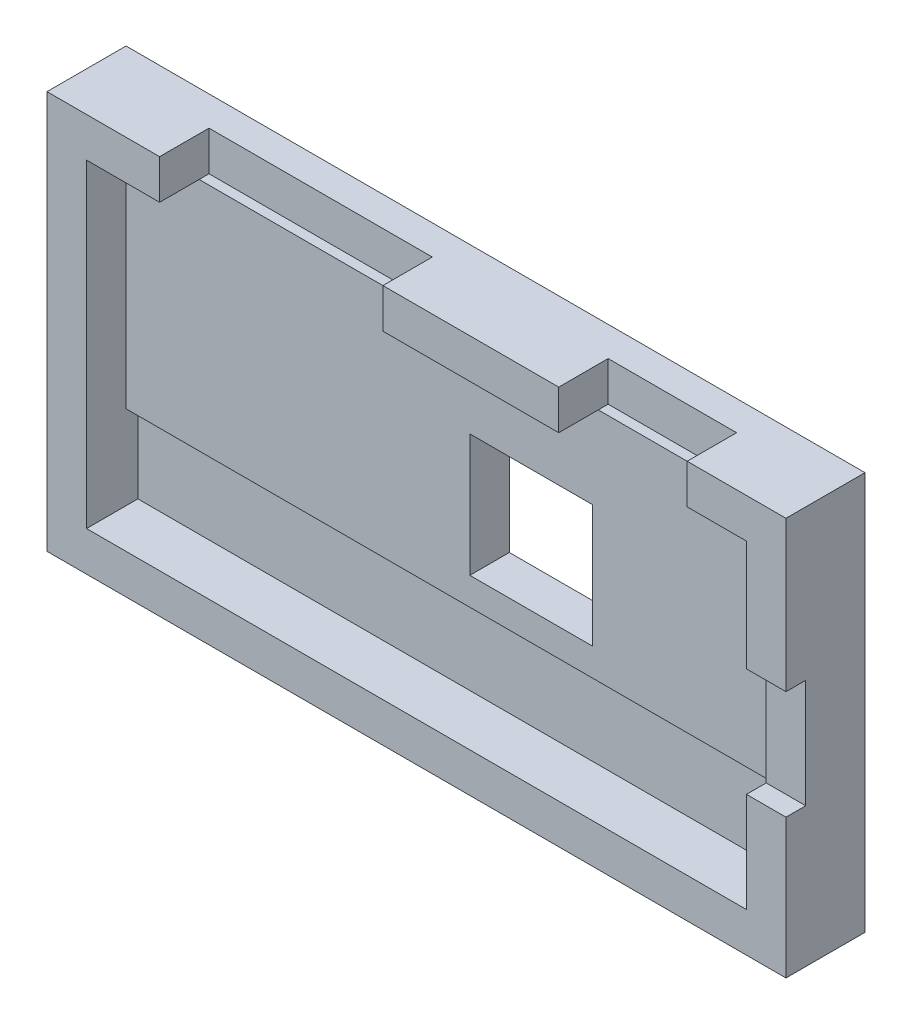
ISO-10303-21;
HEADER;
FILE_DESCRIPTION(('STEP AP214'),'2;1');
FILE_NAME('part.step','',(''),(''),'','','');
FILE_SCHEMA(('AUTOMOTIVE_DESIGN { 1 0 10303 214 1 1 1 1 }'));
ENDSEC;
DATA;
#1=APPLICATION_CONTEXT('core data for automotive mechanical design processes');
#2=APPLICATION_PROTOCOL_DEFINITION('international standard','automotive_design',2000,#1);
#3=PRODUCT_CONTEXT('',#1,'mechanical');
#4=PRODUCT('Part','Part','',(#3));
#5=PRODUCT_RELATED_PRODUCT_CATEGORY('part','',(#4));
#6=PRODUCT_DEFINITION_FORMATION('','',#4);
#7=PRODUCT_DEFINITION_CONTEXT('part definition',#1,'design');
#8=PRODUCT_DEFINITION('design','',#6,#7);
#9=PRODUCT_DEFINITION_SHAPE('','',#8);
#10=(LENGTH_UNIT() NAMED_UNIT(*) SI_UNIT(.MILLI.,.METRE.));
#11=(NAMED_UNIT(*) PLANE_ANGLE_UNIT() SI_UNIT($,.RADIAN.));
#12=(NAMED_UNIT(*) SI_UNIT($,.STERADIAN.) SOLID_ANGLE_UNIT());
#13=UNCERTAINTY_MEASURE_WITH_UNIT(LENGTH_MEASURE(1.E-05),#10,'distance_accuracy_value','');
#14=(GEOMETRIC_REPRESENTATION_CONTEXT(3) GLOBAL_UNCERTAINTY_ASSIGNED_CONTEXT((#13)) GLOBAL_UNIT_ASSIGNED_CONTEXT((#10,
#11,#12)) REPRESENTATION_CONTEXT('',''));
#15=CARTESIAN_POINT('',(0.,0.,0.));
#16=DIRECTION('',(0.,0.,1.));
#17=DIRECTION('',(1.,0.,0.));
#18=AXIS2_PLACEMENT_3D('',#15,#16,#17);
#19=CARTESIAN_POINT('',(0.,0.,8.));
#20=DIRECTION('',(0.,0.,-1.));
#21=DIRECTION('',(-1.,0.,0.));
#22=AXIS2_PLACEMENT_3D('',#19,#20,#21);
#23=PLANE('',#22);
#24=DIRECTION('',(1.,0.,0.));
#25=VECTOR('',#24,1.);
#26=CARTESIAN_POINT('',(0.,20.0792414405778,8.));
#27=LINE('',#26,#25);
#28=CARTESIAN_POINT('',(26.4591512095298,20.0792414405778,8.));
#29=VERTEX_POINT('',#28);
#30=CARTESIAN_POINT('',(36.4591512095298,20.0792414405778,8.));
#31=VERTEX_POINT('',#30);
#32=EDGE_CURVE('E483',#29,#31,#27,.T.);
#33=ORIENTED_EDGE('',*,*,#32,.F.);
#34=DIRECTION('',(0.,1.,0.));
#35=VECTOR('',#34,1.);
#36=CARTESIAN_POINT('',(26.4591512095298,16.0792414405778,8.));
#37=LINE('',#36,#35);
#38=CARTESIAN_POINT('',(26.4591512095298,16.0792414405778,8.));
#39=VERTEX_POINT('',#38);
#40=EDGE_CURVE('E314',#39,#29,#37,.T.);
#41=ORIENTED_EDGE('',*,*,#40,.F.);
#42=DIRECTION('',(1.,0.,0.));
#43=VECTOR('',#42,1.);
#44=CARTESIAN_POINT('',(-34.3408487904702,16.0792414405778,8.));
#45=LINE('',#44,#43);
#46=CARTESIAN_POINT('',(32.4591512095298,16.0792414405778,8.));
#47=VERTEX_POINT('',#46);
#48=EDGE_CURVE('E454',#39,#47,#45,.T.);
#49=ORIENTED_EDGE('',*,*,#48,.T.);
#50=DIRECTION('',(0.,-1.,0.));
#51=VECTOR('',#50,1.);
#52=CARTESIAN_POINT('',(32.4591512095298,16.0792414405778,8.));
#53=LINE('',#52,#51);
#54=CARTESIAN_POINT('',(32.4591512095298,4.87924144057779,8.));
#55=VERTEX_POINT('',#54);
#56=EDGE_CURVE('E455',#47,#55,#53,.T.);
#57=ORIENTED_EDGE('',*,*,#56,.T.);
#58=DIRECTION('',(-1.,0.,0.));
#59=VECTOR('',#58,1.);
#60=CARTESIAN_POINT('',(32.4591512095298,4.87924144057779,8.));
#61=LINE('',#60,#59);
#62=CARTESIAN_POINT('',(36.4591512095298,4.87924144057779,8.));
#63=VERTEX_POINT('',#62);
#64=EDGE_CURVE('E403',#63,#55,#61,.T.);
#65=ORIENTED_EDGE('',*,*,#64,.F.);
#66=DIRECTION('',(0.,-1.,0.));
#67=VECTOR('',#66,1.);
#68=CARTESIAN_POINT('',(36.4591512095298,0.,8.));
#69=LINE('',#68,#67);
#70=EDGE_CURVE('E499',#31,#63,#69,.T.);
#71=ORIENTED_EDGE('',*,*,#70,.F.);
#72=EDGE_LOOP('',(#33,#41,#49,#57,#65,#71));
#73=FACE_BOUND('',#72,.T.);
#74=ADVANCED_FACE('F62',(#73),#23,.F.);
#75=CARTESIAN_POINT('',(-4.34084879047024,16.0792414405778,8.));
#76=VERTEX_POINT('',#75);
#77=CARTESIAN_POINT('',(13.4591512095298,16.0792414405778,8.));
#78=VERTEX_POINT('',#77);
#79=EDGE_CURVE('E453',#76,#78,#45,.T.);
#80=ORIENTED_EDGE('',*,*,#79,.T.);
#81=DIRECTION('',(0.,-1.,0.));
#82=VECTOR('',#81,1.);
#83=CARTESIAN_POINT('',(13.4591512095298,16.0792414405778,8.));
#84=LINE('',#83,#82);
#85=CARTESIAN_POINT('',(13.4591512095298,20.0792414405778,8.));
#86=VERTEX_POINT('',#85);
#87=EDGE_CURVE('E301',#86,#78,#84,.T.);
#88=ORIENTED_EDGE('',*,*,#87,.F.);
#89=CARTESIAN_POINT('',(-4.34084879047024,20.0792414405778,8.));
#90=VERTEX_POINT('',#89);
#91=EDGE_CURVE('E498',#90,#86,#27,.T.);
#92=ORIENTED_EDGE('',*,*,#91,.F.);
#93=DIRECTION('',(0.,1.,0.));
#94=VECTOR('',#93,1.);
#95=CARTESIAN_POINT('',(-4.34084879047024,16.0792414405778,8.));
#96=LINE('',#95,#94);
#97=EDGE_CURVE('E264',#76,#90,#96,.T.);
#98=ORIENTED_EDGE('',*,*,#97,.F.);
#99=EDGE_LOOP('',(#80,#88,#92,#98));
#100=FACE_BOUND('',#99,.T.);
#101=ADVANCED_FACE('F602',(#100),#23,.F.);
#102=CARTESIAN_POINT('',(-34.3408487904702,16.0792414405778,8.));
#103=DIRECTION('',(0.,1.,0.));
#104=DIRECTION('',(0.,0.,1.));
#105=AXIS2_PLACEMENT_3D('',#102,#103,#104);
#106=PLANE('',#105);
#107=ORIENTED_EDGE('',*,*,#48,.F.);
#108=DIRECTION('',(0.,0.,1.));
#109=VECTOR('',#108,1.);
#110=CARTESIAN_POINT('',(26.4591512095298,16.0792414405778,3.));
#111=LINE('',#110,#109);
#112=CARTESIAN_POINT('',(26.4591512095298,16.0792414405778,4.));
#113=VERTEX_POINT('',#112);
#114=EDGE_CURVE('E325',#113,#39,#111,.T.);
#115=ORIENTED_EDGE('',*,*,#114,.F.);
#116=DIRECTION('',(1.,0.,0.));
#117=VECTOR('',#116,1.);
#118=CARTESIAN_POINT('',(-34.3408487904702,16.0792414405778,4.));
#119=LINE('',#118,#117);
#120=CARTESIAN_POINT('',(32.4591512095298,16.0792414405778,4.));
#121=VERTEX_POINT('',#120);
#122=EDGE_CURVE('E447',#113,#121,#119,.T.);
#123=ORIENTED_EDGE('',*,*,#122,.T.);
#124=DIRECTION('',(0.,0.,-1.));
#125=VECTOR('',#124,1.);
#126=CARTESIAN_POINT('',(32.4591512095298,16.0792414405778,8.));
#127=LINE('',#126,#125);
#128=EDGE_CURVE('E466',#47,#121,#127,.T.);
#129=ORIENTED_EDGE('',*,*,#128,.F.);
#130=EDGE_LOOP('',(#107,#115,#123,#129));
#131=FACE_BOUND('',#130,.T.);
#132=ADVANCED_FACE('F666',(#131),#106,.F.);
#133=CARTESIAN_POINT('',(-4.34084879047024,16.0792414405778,4.));
#134=VERTEX_POINT('',#133);
#135=CARTESIAN_POINT('',(13.4591512095298,16.0792414405778,4.));
#136=VERTEX_POINT('',#135);
#137=EDGE_CURVE('E611',#134,#136,#119,.T.);
#138=ORIENTED_EDGE('',*,*,#137,.T.);
#139=DIRECTION('',(0.,0.,1.));
#140=VECTOR('',#139,1.);
#141=CARTESIAN_POINT('',(13.4591512095298,16.0792414405778,3.));
#142=LINE('',#141,#140);
#143=EDGE_CURVE('E329',#136,#78,#142,.T.);
#144=ORIENTED_EDGE('',*,*,#143,.T.);
#145=ORIENTED_EDGE('',*,*,#79,.F.);
#146=DIRECTION('',(0.,0.,1.));
#147=VECTOR('',#146,1.);
#148=CARTESIAN_POINT('',(-4.34084879047024,16.0792414405778,3.));
#149=LINE('',#148,#147);
#150=EDGE_CURVE('E361',#134,#76,#149,.T.);
#151=ORIENTED_EDGE('',*,*,#150,.F.);
#152=EDGE_LOOP('',(#138,#144,#145,#151));
#153=FACE_BOUND('',#152,.T.);
#154=ADVANCED_FACE('F673',(#153),#106,.F.);
#155=CARTESIAN_POINT('',(-38.3408487904702,20.0792414405778,4.));
#156=DIRECTION('',(1.,0.,0.));
#157=DIRECTION('',(0.,1.,0.));
#158=AXIS2_PLACEMENT_3D('',#155,#156,#157);
#159=PLANE('',#158);
#160=DIRECTION('',(0.,-1.,0.));
#161=VECTOR('',#160,1.);
#162=CARTESIAN_POINT('',(-38.3408487904702,20.0792414405778,0.));
#163=LINE('',#162,#161);
#164=CARTESIAN_POINT('',(-38.3408487904702,20.0792414405778,0.));
#165=VERTEX_POINT('',#164);
#166=CARTESIAN_POINT('',(-38.3408487904702,-20.2207585594222,0.));
#167=VERTEX_POINT('',#166);
#168=EDGE_CURVE('E511',#165,#167,#163,.T.);
#169=ORIENTED_EDGE('',*,*,#168,.T.);
#170=DIRECTION('',(0.,0.,-1.));
#171=VECTOR('',#170,1.);
#172=CARTESIAN_POINT('',(-38.3408487904702,-20.2207585594222,4.));
#173=LINE('',#172,#171);
#174=CARTESIAN_POINT('',(-38.3408487904702,-20.2207585594222,8.));
#175=VERTEX_POINT('',#174);
#176=EDGE_CURVE('E536',#175,#167,#173,.T.);
#177=ORIENTED_EDGE('',*,*,#176,.F.);
#178=DIRECTION('',(0.,-1.,0.));
#179=VECTOR('',#178,1.);
#180=CARTESIAN_POINT('',(-38.3408487904702,0.,8.));
#181=LINE('',#180,#179);
#182=CARTESIAN_POINT('',(-38.3408487904702,20.0792414405778,8.));
#183=VERTEX_POINT('',#182);
#184=EDGE_CURVE('E507',#183,#175,#181,.T.);
#185=ORIENTED_EDGE('',*,*,#184,.F.);
#186=DIRECTION('',(0.,0.,-1.));
#187=VECTOR('',#186,1.);
#188=CARTESIAN_POINT('',(-38.3408487904702,20.0792414405778,4.));
#189=LINE('',#188,#187);
#190=EDGE_CURVE('E527',#183,#165,#189,.T.);
#191=ORIENTED_EDGE('',*,*,#190,.T.);
#192=EDGE_LOOP('',(#169,#177,#185,#191));
#193=FACE_BOUND('',#192,.T.);
#194=ADVANCED_FACE('F64',(#193),#159,.F.);
#195=CARTESIAN_POINT('',(-38.3408487904702,-20.2207585594222,4.));
#196=DIRECTION('',(0.,1.,0.));
#197=DIRECTION('',(0.,0.,1.));
#198=AXIS2_PLACEMENT_3D('',#195,#196,#197);
#199=PLANE('',#198);
#200=DIRECTION('',(1.,0.,0.));
#201=VECTOR('',#200,1.);
#202=CARTESIAN_POINT('',(-38.3408487904702,-20.2207585594222,0.));
#203=LINE('',#202,#201);
#204=CARTESIAN_POINT('',(36.4591512095298,-20.2207585594222,0.));
#205=VERTEX_POINT('',#204);
#206=EDGE_CURVE('E515',#167,#205,#203,.T.);
#207=ORIENTED_EDGE('',*,*,#206,.T.);
#208=DIRECTION('',(0.,0.,-1.));
#209=VECTOR('',#208,1.);
#210=CARTESIAN_POINT('',(36.4591512095298,-20.2207585594222,4.));
#211=LINE('',#210,#209);
#212=CARTESIAN_POINT('',(36.4591512095298,-20.2207585594222,8.));
#213=VERTEX_POINT('',#212);
#214=EDGE_CURVE('E533',#213,#205,#211,.T.);
#215=ORIENTED_EDGE('',*,*,#214,.F.);
#216=DIRECTION('',(1.,0.,0.));
#217=VECTOR('',#216,1.);
#218=CARTESIAN_POINT('',(0.,-20.2207585594222,8.));
#219=LINE('',#218,#217);
#220=EDGE_CURVE('E503',#175,#213,#219,.T.);
#221=ORIENTED_EDGE('',*,*,#220,.F.);
#222=ORIENTED_EDGE('',*,*,#176,.T.);
#223=EDGE_LOOP('',(#207,#215,#221,#222));
#224=FACE_BOUND('',#223,.T.);
#225=ADVANCED_FACE('F578',(#224),#199,.F.);
#226=CARTESIAN_POINT('',(36.4591512095298,20.0792414405778,4.));
#227=DIRECTION('',(1.,0.,0.));
#228=DIRECTION('',(0.,1.,0.));
#229=AXIS2_PLACEMENT_3D('',#226,#227,#228);
#230=PLANE('',#229);
#231=DIRECTION('',(0.,0.,1.));
#232=VECTOR('',#231,1.);
#233=CARTESIAN_POINT('',(36.4591512095298,4.87924144057779,6.));
#234=LINE('',#233,#232);
#235=CARTESIAN_POINT('',(36.4591512095298,4.87924144057779,6.));
#236=VERTEX_POINT('',#235);
#237=EDGE_CURVE('E423',#236,#63,#234,.T.);
#238=ORIENTED_EDGE('',*,*,#237,.F.);
#239=DIRECTION('',(0.,1.,0.));
#240=VECTOR('',#239,1.);
#241=CARTESIAN_POINT('',(36.4591512095298,4.87924144057779,6.));
#242=LINE('',#241,#240);
#243=CARTESIAN_POINT('',(36.4591512095298,-6.1207585594222,6.));
#244=VERTEX_POINT('',#243);
#245=EDGE_CURVE('E407',#244,#236,#242,.T.);
#246=ORIENTED_EDGE('',*,*,#245,.F.);
#247=DIRECTION('',(0.,0.,1.));
#248=VECTOR('',#247,1.);
#249=CARTESIAN_POINT('',(36.4591512095298,-6.1207585594222,6.));
#250=LINE('',#249,#248);
#251=CARTESIAN_POINT('',(36.4591512095298,-6.1207585594222,8.));
#252=VERTEX_POINT('',#251);
#253=EDGE_CURVE('E426',#244,#252,#250,.T.);
#254=ORIENTED_EDGE('',*,*,#253,.T.);
#255=EDGE_CURVE('E497',#252,#213,#69,.T.);
#256=ORIENTED_EDGE('',*,*,#255,.T.);
#257=ORIENTED_EDGE('',*,*,#214,.T.);
#258=DIRECTION('',(0.,-1.,0.));
#259=VECTOR('',#258,1.);
#260=CARTESIAN_POINT('',(36.4591512095298,20.0792414405778,0.));
#261=LINE('',#260,#259);
#262=CARTESIAN_POINT('',(36.4591512095298,20.0792414405778,0.));
#263=VERTEX_POINT('',#262);
#264=EDGE_CURVE('E519',#263,#205,#261,.T.);
#265=ORIENTED_EDGE('',*,*,#264,.F.);
#266=DIRECTION('',(0.,0.,-1.));
#267=VECTOR('',#266,1.);
#268=CARTESIAN_POINT('',(36.4591512095298,20.0792414405778,4.));
#269=LINE('',#268,#267);
#270=EDGE_CURVE('E530',#31,#263,#269,.T.);
#271=ORIENTED_EDGE('',*,*,#270,.F.);
#272=ORIENTED_EDGE('',*,*,#70,.T.);
#273=EDGE_LOOP('',(#238,#246,#254,#256,#257,#265,#271,#272));
#274=FACE_BOUND('',#273,.T.);
#275=ADVANCED_FACE('F573',(#274),#230,.T.);
#276=CARTESIAN_POINT('',(-38.3408487904702,20.0792414405778,4.));
#277=DIRECTION('',(0.,1.,0.));
#278=DIRECTION('',(-1.,0.,0.));
#279=AXIS2_PLACEMENT_3D('',#276,#277,#278);
#280=PLANE('',#279);
#281=DIRECTION('',(0.,0.,1.));
#282=VECTOR('',#281,1.);
#283=CARTESIAN_POINT('',(26.4591512095298,20.0792414405778,3.));
#284=LINE('',#283,#282);
#285=CARTESIAN_POINT('',(26.4591512095298,20.0792414405778,3.));
#286=VERTEX_POINT('',#285);
#287=EDGE_CURVE('E313',#286,#29,#284,.T.);
#288=ORIENTED_EDGE('',*,*,#287,.T.);
#289=ORIENTED_EDGE('',*,*,#32,.T.);
#290=ORIENTED_EDGE('',*,*,#270,.T.);
#291=DIRECTION('',(1.,0.,0.));
#292=VECTOR('',#291,1.);
#293=CARTESIAN_POINT('',(-38.3408487904702,20.0792414405778,0.));
#294=LINE('',#293,#292);
#295=EDGE_CURVE('E523',#165,#263,#294,.T.);
#296=ORIENTED_EDGE('',*,*,#295,.F.);
#297=ORIENTED_EDGE('',*,*,#190,.F.);
#298=CARTESIAN_POINT('',(-26.9408487904702,20.0792414405778,8.));
#299=VERTEX_POINT('',#298);
#300=EDGE_CURVE('E493',#183,#299,#27,.T.);
#301=ORIENTED_EDGE('',*,*,#300,.T.);
#302=DIRECTION('',(0.,0.,1.));
#303=VECTOR('',#302,1.);
#304=CARTESIAN_POINT('',(-26.9408487904702,20.0792414405778,3.));
#305=LINE('',#304,#303);
#306=CARTESIAN_POINT('',(-26.9408487904702,20.0792414405778,3.));
#307=VERTEX_POINT('',#306);
#308=EDGE_CURVE('E366',#307,#299,#305,.T.);
#309=ORIENTED_EDGE('',*,*,#308,.F.);
#310=DIRECTION('',(-1.,0.,0.));
#311=VECTOR('',#310,1.);
#312=CARTESIAN_POINT('',(-4.34084879047024,20.0792414405778,3.));
#313=LINE('',#312,#311);
#314=CARTESIAN_POINT('',(-4.34084879047024,20.0792414405778,3.));
#315=VERTEX_POINT('',#314);
#316=EDGE_CURVE('E340',#315,#307,#313,.T.);
#317=ORIENTED_EDGE('',*,*,#316,.F.);
#318=DIRECTION('',(0.,0.,1.));
#319=VECTOR('',#318,1.);
#320=CARTESIAN_POINT('',(-4.34084879047024,20.0792414405778,3.));
#321=LINE('',#320,#319);
#322=EDGE_CURVE('E353',#315,#90,#321,.T.);
#323=ORIENTED_EDGE('',*,*,#322,.T.);
#324=ORIENTED_EDGE('',*,*,#91,.T.);
#325=DIRECTION('',(0.,0.,1.));
#326=VECTOR('',#325,1.);
#327=CARTESIAN_POINT('',(13.4591512095298,20.0792414405778,3.));
#328=LINE('',#327,#326);
#329=CARTESIAN_POINT('',(13.4591512095298,20.0792414405778,3.));
#330=VERTEX_POINT('',#329);
#331=EDGE_CURVE('E330',#330,#86,#328,.T.);
#332=ORIENTED_EDGE('',*,*,#331,.F.);
#333=DIRECTION('',(-1.,0.,0.));
#334=VECTOR('',#333,1.);
#335=CARTESIAN_POINT('',(26.4591512095298,20.0792414405778,3.));
#336=LINE('',#335,#334);
#337=EDGE_CURVE('E300',#286,#330,#336,.T.);
#338=ORIENTED_EDGE('',*,*,#337,.F.);
#339=EDGE_LOOP('',(#288,#289,#290,#296,#297,#301,#309,#317,#323,#324,#332,#338));
#340=FACE_BOUND('',#339,.T.);
#341=ADVANCED_FACE('F556',(#340),#280,.T.);
#342=CARTESIAN_POINT('',(0.,0.,0.));
#343=DIRECTION('',(0.,0.,1.));
#344=DIRECTION('',(1.,0.,0.));
#345=AXIS2_PLACEMENT_3D('',#342,#343,#344);
#346=PLANE('',#345);
#347=DIRECTION('',(-1.,0.,0.));
#348=VECTOR('',#347,1.);
#349=CARTESIAN_POINT('',(12.8591512095298,-4.92075855942221,0.));
#350=LINE('',#349,#348);
#351=CARTESIAN_POINT('',(12.8591512095298,-4.92075855942221,0.));
#352=VERTEX_POINT('',#351);
#353=CARTESIAN_POINT('',(0.459151209529758,-4.92075855942221,0.));
#354=VERTEX_POINT('',#353);
#355=EDGE_CURVE('E270',#352,#354,#350,.T.);
#356=ORIENTED_EDGE('',*,*,#355,.F.);
#357=DIRECTION('',(0.,-1.,0.));
#358=VECTOR('',#357,1.);
#359=CARTESIAN_POINT('',(12.8591512095298,-4.92075855942221,0.));
#360=LINE('',#359,#358);
#361=CARTESIAN_POINT('',(12.8591512095298,7.47924144057779,0.));
#362=VERTEX_POINT('',#361);
#363=EDGE_CURVE('E250',#362,#352,#360,.T.);
#364=ORIENTED_EDGE('',*,*,#363,.F.);
#365=DIRECTION('',(1.,0.,0.));
#366=VECTOR('',#365,1.);
#367=CARTESIAN_POINT('',(12.8591512095298,7.47924144057779,0.));
#368=LINE('',#367,#366);
#369=CARTESIAN_POINT('',(0.459151209529758,7.47924144057779,0.));
#370=VERTEX_POINT('',#369);
#371=EDGE_CURVE('E260',#370,#362,#368,.T.);
#372=ORIENTED_EDGE('',*,*,#371,.F.);
#373=DIRECTION('',(0.,1.,0.));
#374=VECTOR('',#373,1.);
#375=CARTESIAN_POINT('',(0.459151209529758,-4.92075855942221,0.));
#376=LINE('',#375,#374);
#377=EDGE_CURVE('E78',#354,#370,#376,.T.);
#378=ORIENTED_EDGE('',*,*,#377,.F.);
#379=EDGE_LOOP('',(#356,#364,#372,#378));
#380=FACE_BOUND('',#379,.T.);
#381=CARTESIAN_POINT('',(-30.3408487904702,-12.2207585594222,0.));
#382=DIRECTION('',(0.,0.,1.));
#383=DIRECTION('',(1.,0.,0.));
#384=AXIS2_PLACEMENT_3D('',#381,#382,#383);
#385=CIRCLE('',#384,2.37361911288066);
#386=CARTESIAN_POINT('',(-27.9672296775896,-12.2207585594222,0.));
#387=VERTEX_POINT('',#386);
#388=EDGE_CURVE('E12',#387,#387,#385,.F.);
#389=ORIENTED_EDGE('',*,*,#388,.F.);
#390=EDGE_LOOP('',(#389));
#391=FACE_BOUND('',#390,.T.);
#392=CARTESIAN_POINT('',(28.4591512095297,-12.2207585594222,0.));
#393=DIRECTION('',(0.,0.,1.));
#394=DIRECTION('',(1.,0.,0.));
#395=AXIS2_PLACEMENT_3D('',#392,#393,#394);
#396=CIRCLE('',#395,2.07603790965965);
#397=CARTESIAN_POINT('',(30.5351891191894,-12.2207585594222,0.));
#398=VERTEX_POINT('',#397);
#399=EDGE_CURVE('E71',#398,#398,#396,.F.);
#400=ORIENTED_EDGE('',*,*,#399,.F.);
#401=EDGE_LOOP('',(#400));
#402=FACE_BOUND('',#401,.T.);
#403=CARTESIAN_POINT('',(-30.3408487904702,12.0792414405778,0.));
#404=DIRECTION('',(0.,0.,1.));
#405=DIRECTION('',(1.,0.,0.));
#406=AXIS2_PLACEMENT_3D('',#403,#404,#405);
#407=CIRCLE('',#406,2.4167692703284);
#408=CARTESIAN_POINT('',(-27.9240795201418,12.0792414405778,0.));
#409=VERTEX_POINT('',#408);
#410=EDGE_CURVE('E544',#409,#409,#407,.F.);
#411=ORIENTED_EDGE('',*,*,#410,.F.);
#412=EDGE_LOOP('',(#411));
#413=FACE_BOUND('',#412,.T.);
#414=CARTESIAN_POINT('',(28.4591512095298,12.0792414405778,0.));
#415=DIRECTION('',(0.,0.,1.));
#416=DIRECTION('',(1.,0.,0.));
#417=AXIS2_PLACEMENT_3D('',#414,#415,#416);
#418=CIRCLE('',#417,2.125481820658);
#419=CARTESIAN_POINT('',(30.5846330301878,12.0792414405778,0.));
#420=VERTEX_POINT('',#419);
#421=EDGE_CURVE('E540',#420,#420,#418,.F.);
#422=ORIENTED_EDGE('',*,*,#421,.F.);
#423=EDGE_LOOP('',(#422));
#424=FACE_BOUND('',#423,.T.);
#425=ORIENTED_EDGE('',*,*,#168,.F.);
#426=ORIENTED_EDGE('',*,*,#295,.T.);
#427=ORIENTED_EDGE('',*,*,#264,.T.);
#428=ORIENTED_EDGE('',*,*,#206,.F.);
#429=EDGE_LOOP('',(#425,#426,#427,#428));
#430=FACE_BOUND('',#429,.T.);
#431=ADVANCED_FACE('F267',(#380,#391,#402,#413,#424,#430),#346,.F.);
#432=CARTESIAN_POINT('',(-34.3408487904702,16.0792414405778,8.));
#433=VERTEX_POINT('',#432);
#434=CARTESIAN_POINT('',(-26.9408487904702,16.0792414405778,8.));
#435=VERTEX_POINT('',#434);
#436=EDGE_CURVE('E448',#433,#435,#45,.T.);
#437=ORIENTED_EDGE('',*,*,#436,.T.);
#438=DIRECTION('',(0.,-1.,0.));
#439=VECTOR('',#438,1.);
#440=CARTESIAN_POINT('',(-26.9408487904702,16.0792414405778,8.));
#441=LINE('',#440,#439);
#442=EDGE_CURVE('E341',#299,#435,#441,.T.);
#443=ORIENTED_EDGE('',*,*,#442,.F.);
#444=ORIENTED_EDGE('',*,*,#300,.F.);
#445=ORIENTED_EDGE('',*,*,#184,.T.);
#446=ORIENTED_EDGE('',*,*,#220,.T.);
#447=ORIENTED_EDGE('',*,*,#255,.F.);
#448=DIRECTION('',(1.,0.,0.));
#449=VECTOR('',#448,1.);
#450=CARTESIAN_POINT('',(32.4591512095298,-6.1207585594222,8.));
#451=LINE('',#450,#449);
#452=CARTESIAN_POINT('',(32.4591512095298,-6.1207585594222,8.));
#453=VERTEX_POINT('',#452);
#454=EDGE_CURVE('E395',#453,#252,#451,.T.);
#455=ORIENTED_EDGE('',*,*,#454,.F.);
#456=CARTESIAN_POINT('',(32.4591512095298,-16.2207585594222,8.));
#457=VERTEX_POINT('',#456);
#458=EDGE_CURVE('E452',#453,#457,#53,.T.);
#459=ORIENTED_EDGE('',*,*,#458,.T.);
#460=DIRECTION('',(1.,0.,0.));
#461=VECTOR('',#460,1.);
#462=CARTESIAN_POINT('',(-34.3408487904702,-16.2207585594222,8.));
#463=LINE('',#462,#461);
#464=CARTESIAN_POINT('',(-34.3408487904702,-16.2207585594222,8.));
#465=VERTEX_POINT('',#464);
#466=EDGE_CURVE('E459',#465,#457,#463,.T.);
#467=ORIENTED_EDGE('',*,*,#466,.F.);
#468=DIRECTION('',(0.,-1.,0.));
#469=VECTOR('',#468,1.);
#470=CARTESIAN_POINT('',(-34.3408487904702,16.0792414405778,8.));
#471=LINE('',#470,#469);
#472=EDGE_CURVE('E463',#433,#465,#471,.T.);
#473=ORIENTED_EDGE('',*,*,#472,.F.);
#474=EDGE_LOOP('',(#437,#443,#444,#445,#446,#447,#455,#459,#467,#473));
#475=FACE_BOUND('',#474,.T.);
#476=ADVANCED_FACE('F555',(#475),#23,.F.);
#477=CARTESIAN_POINT('',(-34.3408487904702,16.0792414405778,4.));
#478=VERTEX_POINT('',#477);
#479=CARTESIAN_POINT('',(-26.9408487904702,16.0792414405778,4.));
#480=VERTEX_POINT('',#479);
#481=EDGE_CURVE('E467',#478,#480,#119,.T.);
#482=ORIENTED_EDGE('',*,*,#481,.T.);
#483=DIRECTION('',(0.,0.,1.));
#484=VECTOR('',#483,1.);
#485=CARTESIAN_POINT('',(-26.9408487904702,16.0792414405778,3.));
#486=LINE('',#485,#484);
#487=EDGE_CURVE('E365',#480,#435,#486,.T.);
#488=ORIENTED_EDGE('',*,*,#487,.T.);
#489=ORIENTED_EDGE('',*,*,#436,.F.);
#490=DIRECTION('',(0.,0.,-1.));
#491=VECTOR('',#490,1.);
#492=CARTESIAN_POINT('',(-34.3408487904702,16.0792414405778,8.));
#493=LINE('',#492,#491);
#494=EDGE_CURVE('E480',#433,#478,#493,.T.);
#495=ORIENTED_EDGE('',*,*,#494,.T.);
#496=EDGE_LOOP('',(#482,#488,#489,#495));
#497=FACE_BOUND('',#496,.T.);
#498=ADVANCED_FACE('F623',(#497),#106,.F.);
#499=CARTESIAN_POINT('',(-34.3408487904702,16.0792414405778,8.));
#500=DIRECTION('',(1.,0.,0.));
#501=DIRECTION('',(0.,1.,0.));
#502=AXIS2_PLACEMENT_3D('',#499,#500,#501);
#503=PLANE('',#502);
#504=DIRECTION('',(0.,-1.,0.));
#505=VECTOR('',#504,1.);
#506=CARTESIAN_POINT('',(-34.3408487904702,16.0792414405778,4.));
#507=LINE('',#506,#505);
#508=CARTESIAN_POINT('',(-34.3408487904702,-7.72075855942221,4.));
#509=VERTEX_POINT('',#508);
#510=EDGE_CURVE('E476',#478,#509,#507,.T.);
#511=ORIENTED_EDGE('',*,*,#510,.F.);
#512=ORIENTED_EDGE('',*,*,#494,.F.);
#513=ORIENTED_EDGE('',*,*,#472,.T.);
#514=DIRECTION('',(0.,0.,-1.));
#515=VECTOR('',#514,1.);
#516=CARTESIAN_POINT('',(-34.3408487904702,-16.2207585594222,8.));
#517=LINE('',#516,#515);
#518=CARTESIAN_POINT('',(-34.3408487904702,-16.2207585594222,2.8));
#519=VERTEX_POINT('',#518);
#520=EDGE_CURVE('E484',#465,#519,#517,.T.);
#521=ORIENTED_EDGE('',*,*,#520,.T.);
#522=DIRECTION('',(0.,-1.,0.));
#523=VECTOR('',#522,1.);
#524=CARTESIAN_POINT('',(-34.3408487904702,-16.2207585594222,2.8));
#525=LINE('',#524,#523);
#526=CARTESIAN_POINT('',(-34.3408487904702,-7.72075855942221,2.8));
#527=VERTEX_POINT('',#526);
#528=EDGE_CURVE('E380',#527,#519,#525,.T.);
#529=ORIENTED_EDGE('',*,*,#528,.F.);
#530=DIRECTION('',(0.,0.,1.));
#531=VECTOR('',#530,1.);
#532=CARTESIAN_POINT('',(-34.3408487904702,-7.72075855942221,2.8));
#533=LINE('',#532,#531);
#534=EDGE_CURVE('E392',#527,#509,#533,.T.);
#535=ORIENTED_EDGE('',*,*,#534,.T.);
#536=EDGE_LOOP('',(#511,#512,#513,#521,#529,#535));
#537=FACE_BOUND('',#536,.T.);
#538=ADVANCED_FACE('F631',(#537),#503,.T.);
#539=CARTESIAN_POINT('',(-34.3408487904702,-16.2207585594222,8.));
#540=DIRECTION('',(0.,1.,0.));
#541=DIRECTION('',(0.,0.,1.));
#542=AXIS2_PLACEMENT_3D('',#539,#540,#541);
#543=PLANE('',#542);
#544=DIRECTION('',(0.,0.,-1.));
#545=VECTOR('',#544,1.);
#546=CARTESIAN_POINT('',(32.4591512095298,-16.2207585594222,8.));
#547=LINE('',#546,#545);
#548=CARTESIAN_POINT('',(32.4591512095298,-16.2207585594222,2.8));
#549=VERTEX_POINT('',#548);
#550=EDGE_CURVE('E487',#457,#549,#547,.T.);
#551=ORIENTED_EDGE('',*,*,#550,.T.);
#552=DIRECTION('',(1.,0.,0.));
#553=VECTOR('',#552,1.);
#554=CARTESIAN_POINT('',(32.4591512095298,-16.2207585594222,2.8));
#555=LINE('',#554,#553);
#556=EDGE_CURVE('E384',#519,#549,#555,.T.);
#557=ORIENTED_EDGE('',*,*,#556,.F.);
#558=ORIENTED_EDGE('',*,*,#520,.F.);
#559=ORIENTED_EDGE('',*,*,#466,.T.);
#560=EDGE_LOOP('',(#551,#557,#558,#559));
#561=FACE_BOUND('',#560,.T.);
#562=ADVANCED_FACE('F635',(#561),#543,.T.);
#563=CARTESIAN_POINT('',(32.4591512095298,16.0792414405778,8.));
#564=DIRECTION('',(1.,0.,0.));
#565=DIRECTION('',(0.,0.,-1.));
#566=AXIS2_PLACEMENT_3D('',#563,#564,#565);
#567=PLANE('',#566);
#568=DIRECTION('',(0.,-1.,0.));
#569=VECTOR('',#568,1.);
#570=CARTESIAN_POINT('',(32.4591512095298,4.87924144057779,6.));
#571=LINE('',#570,#569);
#572=CARTESIAN_POINT('',(32.4591512095298,4.87924144057779,6.));
#573=VERTEX_POINT('',#572);
#574=CARTESIAN_POINT('',(32.4591512095298,-6.1207585594222,6.));
#575=VERTEX_POINT('',#574);
#576=EDGE_CURVE('E398',#573,#575,#571,.T.);
#577=ORIENTED_EDGE('',*,*,#576,.F.);
#578=DIRECTION('',(0.,0.,1.));
#579=VECTOR('',#578,1.);
#580=CARTESIAN_POINT('',(32.4591512095298,4.87924144057779,6.));
#581=LINE('',#580,#579);
#582=EDGE_CURVE('E418',#573,#55,#581,.T.);
#583=ORIENTED_EDGE('',*,*,#582,.T.);
#584=ORIENTED_EDGE('',*,*,#56,.F.);
#585=ORIENTED_EDGE('',*,*,#128,.T.);
#586=DIRECTION('',(0.,-1.,0.));
#587=VECTOR('',#586,1.);
#588=CARTESIAN_POINT('',(32.4591512095298,16.0792414405778,4.));
#589=LINE('',#588,#587);
#590=CARTESIAN_POINT('',(32.4591512095298,-7.7207585594222,4.));
#591=VERTEX_POINT('',#590);
#592=EDGE_CURVE('E471',#121,#591,#589,.T.);
#593=ORIENTED_EDGE('',*,*,#592,.T.);
#594=DIRECTION('',(0.,0.,1.));
#595=VECTOR('',#594,1.);
#596=CARTESIAN_POINT('',(32.4591512095298,-7.7207585594222,2.8));
#597=LINE('',#596,#595);
#598=CARTESIAN_POINT('',(32.4591512095298,-7.7207585594222,2.8));
#599=VERTEX_POINT('',#598);
#600=EDGE_CURVE('E388',#599,#591,#597,.T.);
#601=ORIENTED_EDGE('',*,*,#600,.F.);
#602=DIRECTION('',(0.,1.,0.));
#603=VECTOR('',#602,1.);
#604=CARTESIAN_POINT('',(32.4591512095298,-16.2207585594222,2.8));
#605=LINE('',#604,#603);
#606=EDGE_CURVE('E372',#549,#599,#605,.T.);
#607=ORIENTED_EDGE('',*,*,#606,.F.);
#608=ORIENTED_EDGE('',*,*,#550,.F.);
#609=ORIENTED_EDGE('',*,*,#458,.F.);
#610=DIRECTION('',(0.,0.,1.));
#611=VECTOR('',#610,1.);
#612=CARTESIAN_POINT('',(32.4591512095298,-6.1207585594222,6.));
#613=LINE('',#612,#611);
#614=EDGE_CURVE('E413',#575,#453,#613,.T.);
#615=ORIENTED_EDGE('',*,*,#614,.F.);
#616=EDGE_LOOP('',(#577,#583,#584,#585,#593,#601,#607,#608,#609,#615));
#617=FACE_BOUND('',#616,.T.);
#618=ADVANCED_FACE('F759',(#617),#567,.F.);
#619=CARTESIAN_POINT('',(0.,0.,4.));
#620=DIRECTION('',(0.,0.,1.));
#621=DIRECTION('',(1.,0.,0.));
#622=AXIS2_PLACEMENT_3D('',#619,#620,#621);
#623=PLANE('',#622);
#624=DIRECTION('',(0.,1.,0.));
#625=VECTOR('',#624,1.);
#626=CARTESIAN_POINT('',(12.8591512095298,-4.92075855942221,4.));
#627=LINE('',#626,#625);
#628=CARTESIAN_POINT('',(12.8591512095298,-4.92075855942221,4.));
#629=VERTEX_POINT('',#628);
#630=CARTESIAN_POINT('',(12.8591512095298,7.47924144057779,4.));
#631=VERTEX_POINT('',#630);
#632=EDGE_CURVE('E86',#629,#631,#627,.T.);
#633=ORIENTED_EDGE('',*,*,#632,.F.);
#634=DIRECTION('',(1.,0.,0.));
#635=VECTOR('',#634,1.);
#636=CARTESIAN_POINT('',(12.8591512095298,-4.92075855942221,4.));
#637=LINE('',#636,#635);
#638=CARTESIAN_POINT('',(0.459151209529758,-4.92075855942221,4.));
#639=VERTEX_POINT('',#638);
#640=EDGE_CURVE('E257',#639,#629,#637,.T.);
#641=ORIENTED_EDGE('',*,*,#640,.F.);
#642=DIRECTION('',(0.,-1.,0.));
#643=VECTOR('',#642,1.);
#644=CARTESIAN_POINT('',(0.459151209529758,-4.92075855942221,4.));
#645=LINE('',#644,#643);
#646=CARTESIAN_POINT('',(0.459151209529758,7.47924144057779,4.));
#647=VERTEX_POINT('',#646);
#648=EDGE_CURVE('E282',#647,#639,#645,.T.);
#649=ORIENTED_EDGE('',*,*,#648,.F.);
#650=DIRECTION('',(-1.,0.,0.));
#651=VECTOR('',#650,1.);
#652=CARTESIAN_POINT('',(12.8591512095298,7.47924144057779,4.));
#653=LINE('',#652,#651);
#654=EDGE_CURVE('E275',#631,#647,#653,.T.);
#655=ORIENTED_EDGE('',*,*,#654,.F.);
#656=EDGE_LOOP('',(#633,#641,#649,#655));
#657=FACE_BOUND('',#656,.T.);
#658=DIRECTION('',(-1.,0.,0.));
#659=VECTOR('',#658,1.);
#660=CARTESIAN_POINT('',(32.4591512095298,-7.7207585594222,4.));
#661=LINE('',#660,#659);
#662=EDGE_CURVE('E324',#591,#509,#661,.T.);
#663=ORIENTED_EDGE('',*,*,#662,.F.);
#664=ORIENTED_EDGE('',*,*,#592,.F.);
#665=ORIENTED_EDGE('',*,*,#122,.F.);
#666=EDGE_CURVE('E614',#136,#113,#119,.T.);
#667=ORIENTED_EDGE('',*,*,#666,.F.);
#668=ORIENTED_EDGE('',*,*,#137,.F.);
#669=EDGE_CURVE('E472',#480,#134,#119,.T.);
#670=ORIENTED_EDGE('',*,*,#669,.F.);
#671=ORIENTED_EDGE('',*,*,#481,.F.);
#672=ORIENTED_EDGE('',*,*,#510,.T.);
#673=EDGE_LOOP('',(#663,#664,#665,#667,#668,#670,#671,#672));
#674=FACE_BOUND('',#673,.T.);
#675=ADVANCED_FACE('F646',(#657,#674),#623,.T.);
#676=CARTESIAN_POINT('',(28.4591512095298,12.0792414405778,-1.));
#677=DIRECTION('',(0.,0.,1.));
#678=DIRECTION('',(1.,0.,0.));
#679=AXIS2_PLACEMENT_3D('',#676,#677,#678);
#680=CYLINDRICAL_SURFACE('',#679,2.125481820658);
#681=CARTESIAN_POINT('',(28.4591512095298,12.0792414405778,-1.));
#682=DIRECTION('',(0.,0.,-1.));
#683=DIRECTION('',(-1.,0.,0.));
#684=AXIS2_PLACEMENT_3D('',#681,#682,#683);
#685=CIRCLE('',#684,2.125481820658);
#686=CARTESIAN_POINT('',(26.3336693888717,12.0792414405778,-1.));
#687=VERTEX_POINT('',#686);
#688=EDGE_CURVE('E443',#687,#687,#685,.T.);
#689=ORIENTED_EDGE('',*,*,#688,.F.);
#690=EDGE_LOOP('',(#689));
#691=FACE_BOUND('',#690,.T.);
#692=ORIENTED_EDGE('',*,*,#421,.T.);
#693=EDGE_LOOP('',(#692));
#694=FACE_BOUND('',#693,.T.);
#695=ADVANCED_FACE('F758',(#691,#694),#680,.T.);
#696=CARTESIAN_POINT('',(28.4591512095298,12.0792414405778,-1.));
#697=DIRECTION('',(0.,0.,-1.));
#698=DIRECTION('',(-1.,0.,0.));
#699=AXIS2_PLACEMENT_3D('',#696,#697,#698);
#700=PLANE('',#699);
#701=ORIENTED_EDGE('',*,*,#688,.T.);
#702=EDGE_LOOP('',(#701));
#703=FACE_BOUND('',#702,.T.);
#704=ADVANCED_FACE('F805',(#703),#700,.T.);
#705=CARTESIAN_POINT('',(-30.3408487904702,12.0792414405778,-1.));
#706=DIRECTION('',(0.,0.,1.));
#707=DIRECTION('',(1.,0.,0.));
#708=AXIS2_PLACEMENT_3D('',#705,#706,#707);
#709=CYLINDRICAL_SURFACE('',#708,2.4167692703284);
#710=CARTESIAN_POINT('',(-30.3408487904702,12.0792414405778,-1.));
#711=DIRECTION('',(0.,0.,-1.));
#712=DIRECTION('',(-1.,0.,0.));
#713=AXIS2_PLACEMENT_3D('',#710,#711,#712);
#714=CIRCLE('',#713,2.4167692703284);
#715=CARTESIAN_POINT('',(-32.7576180607986,12.0792414405778,-1.));
#716=VERTEX_POINT('',#715);
#717=EDGE_CURVE('E439',#716,#716,#714,.T.);
#718=ORIENTED_EDGE('',*,*,#717,.F.);
#719=EDGE_LOOP('',(#718));
#720=FACE_BOUND('',#719,.T.);
#721=ORIENTED_EDGE('',*,*,#410,.T.);
#722=EDGE_LOOP('',(#721));
#723=FACE_BOUND('',#722,.T.);
#724=ADVANCED_FACE('F814',(#720,#723),#709,.T.);
#725=CARTESIAN_POINT('',(-30.3408487904702,12.0792414405778,-1.));
#726=DIRECTION('',(0.,0.,-1.));
#727=DIRECTION('',(-1.,0.,0.));
#728=AXIS2_PLACEMENT_3D('',#725,#726,#727);
#729=PLANE('',#728);
#730=ORIENTED_EDGE('',*,*,#717,.T.);
#731=EDGE_LOOP('',(#730));
#732=FACE_BOUND('',#731,.T.);
#733=ADVANCED_FACE('F822',(#732),#729,.T.);
#734=CARTESIAN_POINT('',(28.4591512095297,-12.2207585594222,-1.));
#735=DIRECTION('',(0.,0.,1.));
#736=DIRECTION('',(1.,0.,0.));
#737=AXIS2_PLACEMENT_3D('',#734,#735,#736);
#738=CYLINDRICAL_SURFACE('',#737,2.07603790965965);
#739=CARTESIAN_POINT('',(28.4591512095297,-12.2207585594222,-1.));
#740=DIRECTION('',(0.,0.,-1.));
#741=DIRECTION('',(-1.,0.,0.));
#742=AXIS2_PLACEMENT_3D('',#739,#740,#741);
#743=CIRCLE('',#742,2.07603790965965);
#744=CARTESIAN_POINT('',(26.3831132998701,-12.2207585594222,-1.));
#745=VERTEX_POINT('',#744);
#746=EDGE_CURVE('E435',#745,#745,#743,.T.);
#747=ORIENTED_EDGE('',*,*,#746,.F.);
#748=EDGE_LOOP('',(#747));
#749=FACE_BOUND('',#748,.T.);
#750=ORIENTED_EDGE('',*,*,#399,.T.);
#751=EDGE_LOOP('',(#750));
#752=FACE_BOUND('',#751,.T.);
#753=ADVANCED_FACE('F551',(#749,#752),#738,.T.);
#754=CARTESIAN_POINT('',(28.4591512095297,-12.2207585594222,-1.));
#755=DIRECTION('',(0.,0.,-1.));
#756=DIRECTION('',(-1.,0.,0.));
#757=AXIS2_PLACEMENT_3D('',#754,#755,#756);
#758=PLANE('',#757);
#759=ORIENTED_EDGE('',*,*,#746,.T.);
#760=EDGE_LOOP('',(#759));
#761=FACE_BOUND('',#760,.T.);
#762=ADVANCED_FACE('F837',(#761),#758,.T.);
#763=CARTESIAN_POINT('',(-30.3408487904702,-12.2207585594222,-1.));
#764=DIRECTION('',(0.,0.,1.));
#765=DIRECTION('',(1.,0.,0.));
#766=AXIS2_PLACEMENT_3D('',#763,#764,#765);
#767=CYLINDRICAL_SURFACE('',#766,2.37361911288066);
#768=CARTESIAN_POINT('',(-30.3408487904702,-12.2207585594222,-1.));
#769=DIRECTION('',(0.,0.,-1.));
#770=DIRECTION('',(-1.,0.,0.));
#771=AXIS2_PLACEMENT_3D('',#768,#769,#770);
#772=CIRCLE('',#771,2.37361911288066);
#773=CARTESIAN_POINT('',(-32.7144679033509,-12.2207585594222,-1.));
#774=VERTEX_POINT('',#773);
#775=EDGE_CURVE('E422',#774,#774,#772,.T.);
#776=ORIENTED_EDGE('',*,*,#775,.F.);
#777=EDGE_LOOP('',(#776));
#778=FACE_BOUND('',#777,.T.);
#779=ORIENTED_EDGE('',*,*,#388,.T.);
#780=EDGE_LOOP('',(#779));
#781=FACE_BOUND('',#780,.T.);
#782=ADVANCED_FACE('F845',(#778,#781),#767,.T.);
#783=CARTESIAN_POINT('',(-30.3408487904702,-12.2207585594222,-1.));
#784=DIRECTION('',(0.,0.,-1.));
#785=DIRECTION('',(-1.,0.,0.));
#786=AXIS2_PLACEMENT_3D('',#783,#784,#785);
#787=PLANE('',#786);
#788=ORIENTED_EDGE('',*,*,#775,.T.);
#789=EDGE_LOOP('',(#788));
#790=FACE_BOUND('',#789,.T.);
#791=ADVANCED_FACE('F853',(#790),#787,.T.);
#792=CARTESIAN_POINT('',(32.4591512095298,4.87924144057779,6.));
#793=DIRECTION('',(0.,1.,0.));
#794=DIRECTION('',(0.,0.,1.));
#795=AXIS2_PLACEMENT_3D('',#792,#793,#794);
#796=PLANE('',#795);
#797=ORIENTED_EDGE('',*,*,#64,.T.);
#798=ORIENTED_EDGE('',*,*,#582,.F.);
#799=DIRECTION('',(-1.,0.,0.));
#800=VECTOR('',#799,1.);
#801=CARTESIAN_POINT('',(32.4591512095298,4.87924144057779,6.));
#802=LINE('',#801,#800);
#803=EDGE_CURVE('E410',#236,#573,#802,.T.);
#804=ORIENTED_EDGE('',*,*,#803,.F.);
#805=ORIENTED_EDGE('',*,*,#237,.T.);
#806=EDGE_LOOP('',(#797,#798,#804,#805));
#807=FACE_BOUND('',#806,.T.);
#808=ADVANCED_FACE('F861',(#807),#796,.F.);
#809=CARTESIAN_POINT('',(32.4591512095298,-6.1207585594222,6.));
#810=DIRECTION('',(0.,-1.,0.));
#811=DIRECTION('',(0.,0.,-1.));
#812=AXIS2_PLACEMENT_3D('',#809,#810,#811);
#813=PLANE('',#812);
#814=ORIENTED_EDGE('',*,*,#454,.T.);
#815=ORIENTED_EDGE('',*,*,#253,.F.);
#816=DIRECTION('',(1.,0.,0.));
#817=VECTOR('',#816,1.);
#818=CARTESIAN_POINT('',(32.4591512095298,-6.1207585594222,6.));
#819=LINE('',#818,#817);
#820=EDGE_CURVE('E402',#575,#244,#819,.T.);
#821=ORIENTED_EDGE('',*,*,#820,.F.);
#822=ORIENTED_EDGE('',*,*,#614,.T.);
#823=EDGE_LOOP('',(#814,#815,#821,#822));
#824=FACE_BOUND('',#823,.T.);
#825=ADVANCED_FACE('F870',(#824),#813,.F.);
#826=CARTESIAN_POINT('',(0.,0.,6.));
#827=DIRECTION('',(0.,0.,1.));
#828=DIRECTION('',(1.,0.,0.));
#829=AXIS2_PLACEMENT_3D('',#826,#827,#828);
#830=PLANE('',#829);
#831=ORIENTED_EDGE('',*,*,#576,.T.);
#832=ORIENTED_EDGE('',*,*,#820,.T.);
#833=ORIENTED_EDGE('',*,*,#245,.T.);
#834=ORIENTED_EDGE('',*,*,#803,.T.);
#835=EDGE_LOOP('',(#831,#832,#833,#834));
#836=FACE_BOUND('',#835,.T.);
#837=ADVANCED_FACE('F878',(#836),#830,.T.);
#838=CARTESIAN_POINT('',(32.4591512095298,-7.7207585594222,2.8));
#839=DIRECTION('',(0.,1.,0.));
#840=DIRECTION('',(-1.,0.,0.));
#841=AXIS2_PLACEMENT_3D('',#838,#839,#840);
#842=PLANE('',#841);
#843=ORIENTED_EDGE('',*,*,#662,.T.);
#844=ORIENTED_EDGE('',*,*,#534,.F.);
#845=DIRECTION('',(-1.,0.,0.));
#846=VECTOR('',#845,1.);
#847=CARTESIAN_POINT('',(32.4591512095298,-7.7207585594222,2.8));
#848=LINE('',#847,#846);
#849=EDGE_CURVE('E376',#599,#527,#848,.T.);
#850=ORIENTED_EDGE('',*,*,#849,.F.);
#851=ORIENTED_EDGE('',*,*,#600,.T.);
#852=EDGE_LOOP('',(#843,#844,#850,#851));
#853=FACE_BOUND('',#852,.T.);
#854=ADVANCED_FACE('F643',(#853),#842,.F.);
#855=CARTESIAN_POINT('',(0.,0.,2.8));
#856=DIRECTION('',(0.,0.,1.));
#857=DIRECTION('',(1.,0.,0.));
#858=AXIS2_PLACEMENT_3D('',#855,#856,#857);
#859=PLANE('',#858);
#860=ORIENTED_EDGE('',*,*,#606,.T.);
#861=ORIENTED_EDGE('',*,*,#849,.T.);
#862=ORIENTED_EDGE('',*,*,#528,.T.);
#863=ORIENTED_EDGE('',*,*,#556,.T.);
#864=EDGE_LOOP('',(#860,#861,#862,#863));
#865=FACE_BOUND('',#864,.T.);
#866=ADVANCED_FACE('F639',(#865),#859,.T.);
#867=CARTESIAN_POINT('',(-4.34084879047024,16.0792414405778,3.));
#868=DIRECTION('',(1.,0.,0.));
#869=DIRECTION('',(0.,1.,0.));
#870=AXIS2_PLACEMENT_3D('',#867,#868,#869);
#871=PLANE('',#870);
#872=ORIENTED_EDGE('',*,*,#97,.T.);
#873=ORIENTED_EDGE('',*,*,#322,.F.);
#874=DIRECTION('',(0.,1.,0.));
#875=VECTOR('',#874,1.);
#876=CARTESIAN_POINT('',(-4.34084879047024,16.0792414405778,3.));
#877=LINE('',#876,#875);
#878=CARTESIAN_POINT('',(-4.34084879047024,16.0792414405778,3.));
#879=VERTEX_POINT('',#878);
#880=EDGE_CURVE('E336',#879,#315,#877,.T.);
#881=ORIENTED_EDGE('',*,*,#880,.F.);
#882=EDGE_CURVE('E317',#879,#134,#149,.T.);
#883=ORIENTED_EDGE('',*,*,#882,.T.);
#884=ORIENTED_EDGE('',*,*,#150,.T.);
#885=EDGE_LOOP('',(#872,#873,#881,#883,#884));
#886=FACE_BOUND('',#885,.T.);
#887=ADVANCED_FACE('F593',(#886),#871,.F.);
#888=CARTESIAN_POINT('',(-4.34084879047024,16.0792414405778,3.));
#889=DIRECTION('',(0.,-1.,0.));
#890=DIRECTION('',(1.,0.,0.));
#891=AXIS2_PLACEMENT_3D('',#888,#889,#890);
#892=PLANE('',#891);
#893=ORIENTED_EDGE('',*,*,#669,.T.);
#894=ORIENTED_EDGE('',*,*,#882,.F.);
#895=DIRECTION('',(1.,0.,0.));
#896=VECTOR('',#895,1.);
#897=CARTESIAN_POINT('',(-4.34084879047024,16.0792414405778,3.));
#898=LINE('',#897,#896);
#899=CARTESIAN_POINT('',(-26.9408487904702,16.0792414405778,3.));
#900=VERTEX_POINT('',#899);
#901=EDGE_CURVE('E349',#900,#879,#898,.T.);
#902=ORIENTED_EDGE('',*,*,#901,.F.);
#903=EDGE_CURVE('E362',#900,#480,#486,.T.);
#904=ORIENTED_EDGE('',*,*,#903,.T.);
#905=EDGE_LOOP('',(#893,#894,#902,#904));
#906=FACE_BOUND('',#905,.T.);
#907=ADVANCED_FACE('F650',(#906),#892,.F.);
#908=CARTESIAN_POINT('',(-26.9408487904702,16.0792414405778,3.));
#909=DIRECTION('',(-1.,0.,0.));
#910=DIRECTION('',(0.,0.,1.));
#911=AXIS2_PLACEMENT_3D('',#908,#909,#910);
#912=PLANE('',#911);
#913=ORIENTED_EDGE('',*,*,#442,.T.);
#914=ORIENTED_EDGE('',*,*,#487,.F.);
#915=ORIENTED_EDGE('',*,*,#903,.F.);
#916=DIRECTION('',(0.,-1.,0.));
#917=VECTOR('',#916,1.);
#918=CARTESIAN_POINT('',(-26.9408487904702,16.0792414405778,3.));
#919=LINE('',#918,#917);
#920=EDGE_CURVE('E345',#307,#900,#919,.T.);
#921=ORIENTED_EDGE('',*,*,#920,.F.);
#922=ORIENTED_EDGE('',*,*,#308,.T.);
#923=EDGE_LOOP('',(#913,#914,#915,#921,#922));
#924=FACE_BOUND('',#923,.T.);
#925=ADVANCED_FACE('F585',(#924),#912,.F.);
#926=CARTESIAN_POINT('',(0.,0.,3.));
#927=DIRECTION('',(0.,0.,1.));
#928=DIRECTION('',(1.,0.,0.));
#929=AXIS2_PLACEMENT_3D('',#926,#927,#928);
#930=PLANE('',#929);
#931=ORIENTED_EDGE('',*,*,#880,.T.);
#932=ORIENTED_EDGE('',*,*,#316,.T.);
#933=ORIENTED_EDGE('',*,*,#920,.T.);
#934=ORIENTED_EDGE('',*,*,#901,.T.);
#935=EDGE_LOOP('',(#931,#932,#933,#934));
#936=FACE_BOUND('',#935,.T.);
#937=ADVANCED_FACE('F590',(#936),#930,.T.);
#938=CARTESIAN_POINT('',(26.4591512095298,16.0792414405778,3.));
#939=DIRECTION('',(1.,0.,0.));
#940=DIRECTION('',(0.,0.,-1.));
#941=AXIS2_PLACEMENT_3D('',#938,#939,#940);
#942=PLANE('',#941);
#943=ORIENTED_EDGE('',*,*,#40,.T.);
#944=ORIENTED_EDGE('',*,*,#287,.F.);
#945=DIRECTION('',(0.,1.,0.));
#946=VECTOR('',#945,1.);
#947=CARTESIAN_POINT('',(26.4591512095298,16.0792414405778,3.));
#948=LINE('',#947,#946);
#949=CARTESIAN_POINT('',(26.4591512095298,16.0792414405778,3.));
#950=VERTEX_POINT('',#949);
#951=EDGE_CURVE('E296',#950,#286,#948,.T.);
#952=ORIENTED_EDGE('',*,*,#951,.F.);
#953=EDGE_CURVE('E320',#950,#113,#111,.T.);
#954=ORIENTED_EDGE('',*,*,#953,.T.);
#955=ORIENTED_EDGE('',*,*,#114,.T.);
#956=EDGE_LOOP('',(#943,#944,#952,#954,#955));
#957=FACE_BOUND('',#956,.T.);
#958=ADVANCED_FACE('F696',(#957),#942,.F.);
#959=CARTESIAN_POINT('',(26.4591512095298,16.0792414405778,3.));
#960=DIRECTION('',(0.,-1.,0.));
#961=DIRECTION('',(1.,0.,0.));
#962=AXIS2_PLACEMENT_3D('',#959,#960,#961);
#963=PLANE('',#962);
#964=ORIENTED_EDGE('',*,*,#666,.T.);
#965=ORIENTED_EDGE('',*,*,#953,.F.);
#966=DIRECTION('',(1.,0.,0.));
#967=VECTOR('',#966,1.);
#968=CARTESIAN_POINT('',(26.4591512095298,16.0792414405778,3.));
#969=LINE('',#968,#967);
#970=CARTESIAN_POINT('',(13.4591512095298,16.0792414405778,3.));
#971=VERTEX_POINT('',#970);
#972=EDGE_CURVE('E309',#971,#950,#969,.T.);
#973=ORIENTED_EDGE('',*,*,#972,.F.);
#974=EDGE_CURVE('E326',#971,#136,#142,.T.);
#975=ORIENTED_EDGE('',*,*,#974,.T.);
#976=EDGE_LOOP('',(#964,#965,#973,#975));
#977=FACE_BOUND('',#976,.T.);
#978=ADVANCED_FACE('F691',(#977),#963,.F.);
#979=CARTESIAN_POINT('',(13.4591512095298,16.0792414405778,3.));
#980=DIRECTION('',(-1.,0.,0.));
#981=DIRECTION('',(0.,-1.,0.));
#982=AXIS2_PLACEMENT_3D('',#979,#980,#981);
#983=PLANE('',#982);
#984=ORIENTED_EDGE('',*,*,#87,.T.);
#985=ORIENTED_EDGE('',*,*,#143,.F.);
#986=ORIENTED_EDGE('',*,*,#974,.F.);
#987=DIRECTION('',(0.,-1.,0.));
#988=VECTOR('',#987,1.);
#989=CARTESIAN_POINT('',(13.4591512095298,16.0792414405778,3.));
#990=LINE('',#989,#988);
#991=EDGE_CURVE('E305',#330,#971,#990,.T.);
#992=ORIENTED_EDGE('',*,*,#991,.F.);
#993=ORIENTED_EDGE('',*,*,#331,.T.);
#994=EDGE_LOOP('',(#984,#985,#986,#992,#993));
#995=FACE_BOUND('',#994,.T.);
#996=ADVANCED_FACE('F688',(#995),#983,.F.);
#997=CARTESIAN_POINT('',(0.,0.,3.));
#998=DIRECTION('',(0.,0.,1.));
#999=DIRECTION('',(1.,0.,0.));
#1000=AXIS2_PLACEMENT_3D('',#997,#998,#999);
#1001=PLANE('',#1000);
#1002=ORIENTED_EDGE('',*,*,#951,.T.);
#1003=ORIENTED_EDGE('',*,*,#337,.T.);
#1004=ORIENTED_EDGE('',*,*,#991,.T.);
#1005=ORIENTED_EDGE('',*,*,#972,.T.);
#1006=EDGE_LOOP('',(#1002,#1003,#1004,#1005));
#1007=FACE_BOUND('',#1006,.T.);
#1008=ADVANCED_FACE('F704',(#1007),#1001,.T.);
#1009=CARTESIAN_POINT('',(12.8591512095298,-4.92075855942221,-1.001));
#1010=DIRECTION('',(1.,0.,0.));
#1011=DIRECTION('',(0.,0.,-1.));
#1012=AXIS2_PLACEMENT_3D('',#1009,#1010,#1011);
#1013=PLANE('',#1012);
#1014=ORIENTED_EDGE('',*,*,#363,.T.);
#1015=DIRECTION('',(0.,0.,1.));
#1016=VECTOR('',#1015,1.);
#1017=CARTESIAN_POINT('',(12.8591512095298,-4.92075855942221,-1.001));
#1018=LINE('',#1017,#1016);
#1019=EDGE_CURVE('E265',#352,#629,#1018,.T.);
#1020=ORIENTED_EDGE('',*,*,#1019,.T.);
#1021=ORIENTED_EDGE('',*,*,#632,.T.);
#1022=DIRECTION('',(0.,0.,1.));
#1023=VECTOR('',#1022,1.);
#1024=CARTESIAN_POINT('',(12.8591512095298,7.47924144057779,-1.001));
#1025=LINE('',#1024,#1023);
#1026=EDGE_CURVE('E246',#362,#631,#1025,.T.);
#1027=ORIENTED_EDGE('',*,*,#1026,.F.);
#1028=EDGE_LOOP('',(#1014,#1020,#1021,#1027));
#1029=FACE_BOUND('',#1028,.T.);
#1030=ADVANCED_FACE('F248',(#1029),#1013,.F.);
#1031=CARTESIAN_POINT('',(12.8591512095298,-4.92075855942221,-1.001));
#1032=DIRECTION('',(0.,-1.,0.));
#1033=DIRECTION('',(1.,0.,0.));
#1034=AXIS2_PLACEMENT_3D('',#1031,#1032,#1033);
#1035=PLANE('',#1034);
#1036=ORIENTED_EDGE('',*,*,#355,.T.);
#1037=DIRECTION('',(0.,0.,1.));
#1038=VECTOR('',#1037,1.);
#1039=CARTESIAN_POINT('',(0.459151209529758,-4.92075855942221,-1.001));
#1040=LINE('',#1039,#1038);
#1041=EDGE_CURVE('E291',#354,#639,#1040,.T.);
#1042=ORIENTED_EDGE('',*,*,#1041,.T.);
#1043=ORIENTED_EDGE('',*,*,#640,.T.);
#1044=ORIENTED_EDGE('',*,*,#1019,.F.);
#1045=EDGE_LOOP('',(#1036,#1042,#1043,#1044));
#1046=FACE_BOUND('',#1045,.T.);
#1047=ADVANCED_FACE('F711',(#1046),#1035,.F.);
#1048=CARTESIAN_POINT('',(0.459151209529758,-4.92075855942221,-1.001));
#1049=DIRECTION('',(-1.,0.,0.));
#1050=DIRECTION('',(0.,0.,1.));
#1051=AXIS2_PLACEMENT_3D('',#1048,#1049,#1050);
#1052=PLANE('',#1051);
#1053=ORIENTED_EDGE('',*,*,#377,.T.);
#1054=DIRECTION('',(0.,0.,1.));
#1055=VECTOR('',#1054,1.);
#1056=CARTESIAN_POINT('',(0.459151209529758,7.47924144057779,-1.001));
#1057=LINE('',#1056,#1055);
#1058=EDGE_CURVE('E256',#370,#647,#1057,.T.);
#1059=ORIENTED_EDGE('',*,*,#1058,.T.);
#1060=ORIENTED_EDGE('',*,*,#648,.T.);
#1061=ORIENTED_EDGE('',*,*,#1041,.F.);
#1062=EDGE_LOOP('',(#1053,#1059,#1060,#1061));
#1063=FACE_BOUND('',#1062,.T.);
#1064=ADVANCED_FACE('F776',(#1063),#1052,.F.);
#1065=CARTESIAN_POINT('',(12.8591512095298,7.47924144057779,-1.001));
#1066=DIRECTION('',(0.,1.,0.));
#1067=DIRECTION('',(-1.,0.,0.));
#1068=AXIS2_PLACEMENT_3D('',#1065,#1066,#1067);
#1069=PLANE('',#1068);
#1070=ORIENTED_EDGE('',*,*,#371,.T.);
#1071=ORIENTED_EDGE('',*,*,#1026,.T.);
#1072=ORIENTED_EDGE('',*,*,#654,.T.);
#1073=ORIENTED_EDGE('',*,*,#1058,.F.);
#1074=EDGE_LOOP('',(#1070,#1071,#1072,#1073));
#1075=FACE_BOUND('',#1074,.T.);
#1076=ADVANCED_FACE('F261',(#1075),#1069,.F.);
#1077=CLOSED_SHELL('',(#74,#101,#132,#154,#194,#225,#275,#341,#431,#476,#498,#538,#562,#618,
#675,#695,#704,#724,#733,#753,#762,#782,#791,#808,#825,#837,#854,#866,#887,#907,#925,#937,#958,
#978,#996,#1008,#1030,#1047,#1064,#1076));
#1078=MANIFOLD_SOLID_BREP('B2',#1077);
#1079=ADVANCED_BREP_SHAPE_REPRESENTATION('',(#18,#1078),#14);
#1080=SHAPE_DEFINITION_REPRESENTATION(#9,#1079);
ENDSEC;
END-ISO-10303-21;
